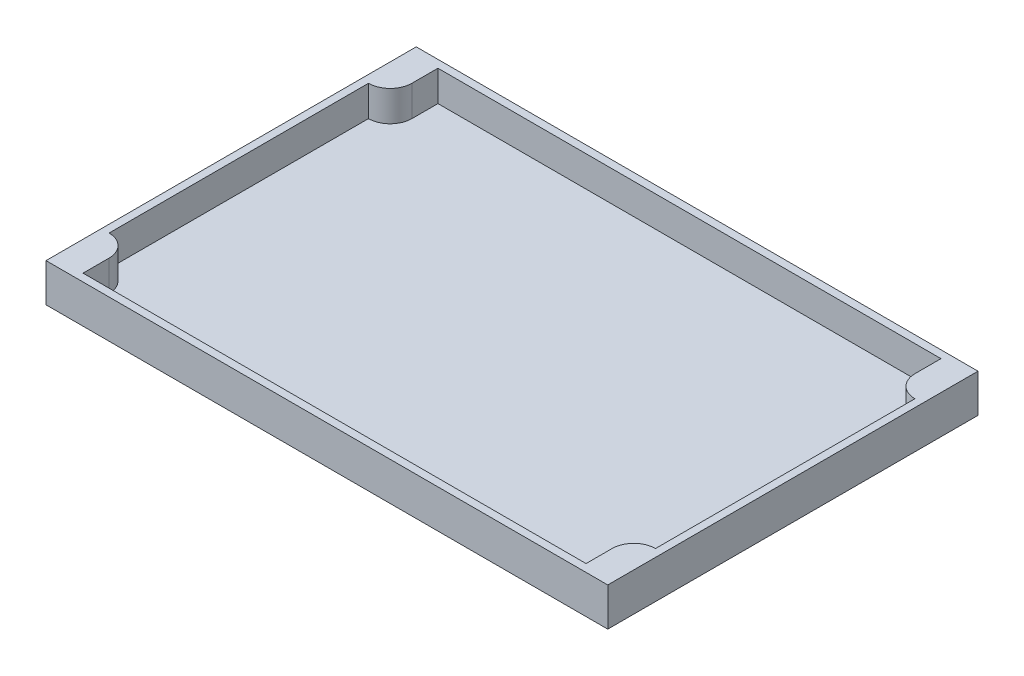
ISO-10303-21;
HEADER;
FILE_DESCRIPTION(('STEP AP214'),'2;1');
FILE_NAME('part.step','',(''),(''),'','','');
FILE_SCHEMA(('AUTOMOTIVE_DESIGN { 1 0 10303 214 1 1 1 1 }'));
ENDSEC;
DATA;
#1=APPLICATION_CONTEXT('core data for automotive mechanical design processes');
#2=APPLICATION_PROTOCOL_DEFINITION('international standard','automotive_design',2000,#1);
#3=PRODUCT_CONTEXT('',#1,'mechanical');
#4=PRODUCT('Part','Part','',(#3));
#5=PRODUCT_RELATED_PRODUCT_CATEGORY('part','',(#4));
#6=PRODUCT_DEFINITION_FORMATION('','',#4);
#7=PRODUCT_DEFINITION_CONTEXT('part definition',#1,'design');
#8=PRODUCT_DEFINITION('design','',#6,#7);
#9=PRODUCT_DEFINITION_SHAPE('','',#8);
#10=(LENGTH_UNIT() NAMED_UNIT(*) SI_UNIT(.MILLI.,.METRE.));
#11=(NAMED_UNIT(*) PLANE_ANGLE_UNIT() SI_UNIT($,.RADIAN.));
#12=(NAMED_UNIT(*) SI_UNIT($,.STERADIAN.) SOLID_ANGLE_UNIT());
#13=UNCERTAINTY_MEASURE_WITH_UNIT(LENGTH_MEASURE(1.E-05),#10,'distance_accuracy_value','');
#14=(GEOMETRIC_REPRESENTATION_CONTEXT(3) GLOBAL_UNCERTAINTY_ASSIGNED_CONTEXT((#13)) GLOBAL_UNIT_ASSIGNED_CONTEXT((#10,
#11,#12)) REPRESENTATION_CONTEXT('',''));
#15=CARTESIAN_POINT('',(0.,0.,0.));
#16=DIRECTION('',(0.,0.,1.));
#17=DIRECTION('',(1.,0.,0.));
#18=AXIS2_PLACEMENT_3D('',#15,#16,#17);
#19=CARTESIAN_POINT('',(0.,3.,0.));
#20=DIRECTION('',(1.,0.,0.));
#21=DIRECTION('',(0.,0.,-1.));
#22=AXIS2_PLACEMENT_3D('',#19,#20,#21);
#23=PLANE('',#22);
#24=DIRECTION('',(0.,0.,1.));
#25=VECTOR('',#24,1.);
#26=CARTESIAN_POINT('',(0.,0.,0.));
#27=LINE('',#26,#25);
#28=CARTESIAN_POINT('',(0.,0.,-145.));
#29=VERTEX_POINT('',#28);
#30=CARTESIAN_POINT('',(0.,0.,0.));
#31=VERTEX_POINT('',#30);
#32=EDGE_CURVE('E181',#29,#31,#27,.T.);
#33=ORIENTED_EDGE('',*,*,#32,.T.);
#34=DIRECTION('',(0.,-1.,0.));
#35=VECTOR('',#34,1.);
#36=CARTESIAN_POINT('',(0.,3.,0.));
#37=LINE('',#36,#35);
#38=CARTESIAN_POINT('',(0.,15.,0.));
#39=VERTEX_POINT('',#38);
#40=EDGE_CURVE('E12',#39,#31,#37,.T.);
#41=ORIENTED_EDGE('',*,*,#40,.F.);
#42=DIRECTION('',(0.,0.,-1.));
#43=VECTOR('',#42,1.);
#44=CARTESIAN_POINT('',(0.,15.,0.));
#45=LINE('',#44,#43);
#46=CARTESIAN_POINT('',(0.,15.,-145.));
#47=VERTEX_POINT('',#46);
#48=EDGE_CURVE('E169',#39,#47,#45,.T.);
#49=ORIENTED_EDGE('',*,*,#48,.T.);
#50=DIRECTION('',(0.,-1.,0.));
#51=VECTOR('',#50,1.);
#52=CARTESIAN_POINT('',(0.,3.,-145.));
#53=LINE('',#52,#51);
#54=EDGE_CURVE('E156',#47,#29,#53,.T.);
#55=ORIENTED_EDGE('',*,*,#54,.T.);
#56=EDGE_LOOP('',(#33,#41,#49,#55));
#57=FACE_BOUND('',#56,.T.);
#58=ADVANCED_FACE('F35',(#57),#23,.F.);
#59=CARTESIAN_POINT('',(0.,3.,0.));
#60=DIRECTION('',(0.,0.,-1.));
#61=DIRECTION('',(-1.,0.,0.));
#62=AXIS2_PLACEMENT_3D('',#59,#60,#61);
#63=PLANE('',#62);
#64=DIRECTION('',(1.,0.,0.));
#65=VECTOR('',#64,1.);
#66=CARTESIAN_POINT('',(0.,0.,0.));
#67=LINE('',#66,#65);
#68=CARTESIAN_POINT('',(220.,0.,0.));
#69=VERTEX_POINT('',#68);
#70=EDGE_CURVE('E202',#31,#69,#67,.T.);
#71=ORIENTED_EDGE('',*,*,#70,.T.);
#72=DIRECTION('',(0.,-1.,0.));
#73=VECTOR('',#72,1.);
#74=CARTESIAN_POINT('',(220.,3.,0.));
#75=LINE('',#74,#73);
#76=CARTESIAN_POINT('',(220.,15.,0.));
#77=VERTEX_POINT('',#76);
#78=EDGE_CURVE('E42',#77,#69,#75,.T.);
#79=ORIENTED_EDGE('',*,*,#78,.F.);
#80=DIRECTION('',(-1.,0.,0.));
#81=VECTOR('',#80,1.);
#82=CARTESIAN_POINT('',(220.,15.,0.));
#83=LINE('',#82,#81);
#84=EDGE_CURVE('E166',#77,#39,#83,.T.);
#85=ORIENTED_EDGE('',*,*,#84,.T.);
#86=ORIENTED_EDGE('',*,*,#40,.T.);
#87=EDGE_LOOP('',(#71,#79,#85,#86));
#88=FACE_BOUND('',#87,.T.);
#89=ADVANCED_FACE('F211',(#88),#63,.F.);
#90=CARTESIAN_POINT('',(220.,3.,0.));
#91=DIRECTION('',(-1.,0.,0.));
#92=DIRECTION('',(0.,0.,1.));
#93=AXIS2_PLACEMENT_3D('',#90,#91,#92);
#94=PLANE('',#93);
#95=DIRECTION('',(0.,0.,-1.));
#96=VECTOR('',#95,1.);
#97=CARTESIAN_POINT('',(220.,0.,0.));
#98=LINE('',#97,#96);
#99=CARTESIAN_POINT('',(220.,0.,-145.));
#100=VERTEX_POINT('',#99);
#101=EDGE_CURVE('E154',#69,#100,#98,.T.);
#102=ORIENTED_EDGE('',*,*,#101,.T.);
#103=DIRECTION('',(0.,-1.,0.));
#104=VECTOR('',#103,1.);
#105=CARTESIAN_POINT('',(220.,3.,-145.));
#106=LINE('',#105,#104);
#107=CARTESIAN_POINT('',(220.,15.,-145.));
#108=VERTEX_POINT('',#107);
#109=EDGE_CURVE('E148',#108,#100,#106,.T.);
#110=ORIENTED_EDGE('',*,*,#109,.F.);
#111=DIRECTION('',(0.,0.,1.));
#112=VECTOR('',#111,1.);
#113=CARTESIAN_POINT('',(220.,15.,0.));
#114=LINE('',#113,#112);
#115=EDGE_CURVE('E152',#108,#77,#114,.T.);
#116=ORIENTED_EDGE('',*,*,#115,.T.);
#117=ORIENTED_EDGE('',*,*,#78,.T.);
#118=EDGE_LOOP('',(#102,#110,#116,#117));
#119=FACE_BOUND('',#118,.T.);
#120=ADVANCED_FACE('F150',(#119),#94,.F.);
#121=CARTESIAN_POINT('',(0.,3.,-145.));
#122=DIRECTION('',(0.,0.,1.));
#123=DIRECTION('',(1.,0.,0.));
#124=AXIS2_PLACEMENT_3D('',#121,#122,#123);
#125=PLANE('',#124);
#126=DIRECTION('',(-1.,0.,0.));
#127=VECTOR('',#126,1.);
#128=CARTESIAN_POINT('',(0.,0.,-145.));
#129=LINE('',#128,#127);
#130=EDGE_CURVE('E57',#100,#29,#129,.T.);
#131=ORIENTED_EDGE('',*,*,#130,.T.);
#132=ORIENTED_EDGE('',*,*,#54,.F.);
#133=DIRECTION('',(1.,0.,0.));
#134=VECTOR('',#133,1.);
#135=CARTESIAN_POINT('',(220.,15.,-145.));
#136=LINE('',#135,#134);
#137=EDGE_CURVE('E163',#47,#108,#136,.T.);
#138=ORIENTED_EDGE('',*,*,#137,.T.);
#139=ORIENTED_EDGE('',*,*,#109,.T.);
#140=EDGE_LOOP('',(#131,#132,#138,#139));
#141=FACE_BOUND('',#140,.T.);
#142=ADVANCED_FACE('F168',(#141),#125,.F.);
#143=CARTESIAN_POINT('',(0.,0.,0.));
#144=DIRECTION('',(0.,-1.,0.));
#145=DIRECTION('',(0.,0.,-1.));
#146=AXIS2_PLACEMENT_3D('',#143,#144,#145);
#147=PLANE('',#146);
#148=ORIENTED_EDGE('',*,*,#32,.F.);
#149=ORIENTED_EDGE('',*,*,#130,.F.);
#150=ORIENTED_EDGE('',*,*,#101,.F.);
#151=ORIENTED_EDGE('',*,*,#70,.F.);
#152=EDGE_LOOP('',(#148,#149,#150,#151));
#153=FACE_BOUND('',#152,.T.);
#154=ADVANCED_FACE('F209',(#153),#147,.T.);
#155=CARTESIAN_POINT('',(3.00000000000001,293.486242525108,-13.2));
#156=DIRECTION('',(0.,-1.,0.));
#157=DIRECTION('',(0.,0.,-1.));
#158=AXIS2_PLACEMENT_3D('',#155,#156,#157);
#159=CYLINDRICAL_SURFACE('',#158,8.5);
#160=CARTESIAN_POINT('',(3.00000000000001,15.,-13.2));
#161=DIRECTION('',(0.,-1.,0.));
#162=DIRECTION('',(0.,0.,-1.));
#163=AXIS2_PLACEMENT_3D('',#160,#161,#162);
#164=CIRCLE('',#163,8.5);
#165=CARTESIAN_POINT('',(11.5,15.,-13.2));
#166=VERTEX_POINT('',#165);
#167=CARTESIAN_POINT('',(3.,15.,-21.7));
#168=VERTEX_POINT('',#167);
#169=EDGE_CURVE('E175',#166,#168,#164,.F.);
#170=ORIENTED_EDGE('',*,*,#169,.F.);
#171=DIRECTION('',(0.,-1.,0.));
#172=VECTOR('',#171,1.);
#173=CARTESIAN_POINT('',(11.5,293.486242525108,-13.2));
#174=LINE('',#173,#172);
#175=CARTESIAN_POINT('',(11.5,3.,-13.2));
#176=VERTEX_POINT('',#175);
#177=EDGE_CURVE('E171',#166,#176,#174,.T.);
#178=ORIENTED_EDGE('',*,*,#177,.T.);
#179=CARTESIAN_POINT('',(3.00000000000001,3.,-13.2));
#180=DIRECTION('',(0.,-1.,0.));
#181=DIRECTION('',(0.,0.,-1.));
#182=AXIS2_PLACEMENT_3D('',#179,#180,#181);
#183=CIRCLE('',#182,8.5);
#184=CARTESIAN_POINT('',(3.,3.,-21.7));
#185=VERTEX_POINT('',#184);
#186=EDGE_CURVE('E49',#185,#176,#183,.T.);
#187=ORIENTED_EDGE('',*,*,#186,.F.);
#188=DIRECTION('',(0.,-1.,0.));
#189=VECTOR('',#188,1.);
#190=CARTESIAN_POINT('',(3.,293.486242525108,-21.7));
#191=LINE('',#190,#189);
#192=EDGE_CURVE('E178',#168,#185,#191,.T.);
#193=ORIENTED_EDGE('',*,*,#192,.F.);
#194=EDGE_LOOP('',(#170,#178,#187,#193));
#195=FACE_BOUND('',#194,.T.);
#196=ADVANCED_FACE('F278',(#195),#159,.T.);
#197=CARTESIAN_POINT('',(11.5,293.486242525108,-13.2));
#198=DIRECTION('',(1.,0.,0.));
#199=DIRECTION('',(0.,0.,-1.));
#200=AXIS2_PLACEMENT_3D('',#197,#198,#199);
#201=PLANE('',#200);
#202=DIRECTION('',(0.,0.,-1.));
#203=VECTOR('',#202,1.);
#204=CARTESIAN_POINT('',(11.5,15.,-13.2));
#205=LINE('',#204,#203);
#206=CARTESIAN_POINT('',(11.5,15.,-3.00000000000001));
#207=VERTEX_POINT('',#206);
#208=EDGE_CURVE('E179',#207,#166,#205,.T.);
#209=ORIENTED_EDGE('',*,*,#208,.F.);
#210=DIRECTION('',(0.,-1.,0.));
#211=VECTOR('',#210,1.);
#212=CARTESIAN_POINT('',(11.5,293.486242525108,-3.00000000000001));
#213=LINE('',#212,#211);
#214=CARTESIAN_POINT('',(11.5,3.,-3.00000000000001));
#215=VERTEX_POINT('',#214);
#216=EDGE_CURVE('E236',#207,#215,#213,.T.);
#217=ORIENTED_EDGE('',*,*,#216,.T.);
#218=DIRECTION('',(0.,0.,1.));
#219=VECTOR('',#218,1.);
#220=CARTESIAN_POINT('',(11.5,3.,-13.2));
#221=LINE('',#220,#219);
#222=EDGE_CURVE('E241',#176,#215,#221,.T.);
#223=ORIENTED_EDGE('',*,*,#222,.F.);
#224=ORIENTED_EDGE('',*,*,#177,.F.);
#225=EDGE_LOOP('',(#209,#217,#223,#224));
#226=FACE_BOUND('',#225,.T.);
#227=ADVANCED_FACE('F284',(#226),#201,.T.);
#228=CARTESIAN_POINT('',(11.5,293.486242525108,-3.00000000000001));
#229=DIRECTION('',(0.,0.,-1.));
#230=DIRECTION('',(-1.,0.,0.));
#231=AXIS2_PLACEMENT_3D('',#228,#229,#230);
#232=PLANE('',#231);
#233=DIRECTION('',(-1.,0.,0.));
#234=VECTOR('',#233,1.);
#235=CARTESIAN_POINT('',(11.5,15.,-3.00000000000001));
#236=LINE('',#235,#234);
#237=CARTESIAN_POINT('',(208.5,15.,-3.00000000000003));
#238=VERTEX_POINT('',#237);
#239=EDGE_CURVE('E182',#238,#207,#236,.T.);
#240=ORIENTED_EDGE('',*,*,#239,.F.);
#241=DIRECTION('',(0.,-1.,0.));
#242=VECTOR('',#241,1.);
#243=CARTESIAN_POINT('',(208.5,293.486242525108,-3.00000000000003));
#244=LINE('',#243,#242);
#245=CARTESIAN_POINT('',(208.5,3.,-3.00000000000003));
#246=VERTEX_POINT('',#245);
#247=EDGE_CURVE('E234',#238,#246,#244,.T.);
#248=ORIENTED_EDGE('',*,*,#247,.T.);
#249=DIRECTION('',(1.,0.,0.));
#250=VECTOR('',#249,1.);
#251=CARTESIAN_POINT('',(11.5,3.,-3.00000000000001));
#252=LINE('',#251,#250);
#253=EDGE_CURVE('E245',#215,#246,#252,.T.);
#254=ORIENTED_EDGE('',*,*,#253,.F.);
#255=ORIENTED_EDGE('',*,*,#216,.F.);
#256=EDGE_LOOP('',(#240,#248,#254,#255));
#257=FACE_BOUND('',#256,.T.);
#258=ADVANCED_FACE('F290',(#257),#232,.T.);
#259=CARTESIAN_POINT('',(208.5,293.486242525108,-13.2000000000001));
#260=DIRECTION('',(-1.,0.,0.));
#261=DIRECTION('',(0.,0.,1.));
#262=AXIS2_PLACEMENT_3D('',#259,#260,#261);
#263=PLANE('',#262);
#264=DIRECTION('',(0.,0.,1.));
#265=VECTOR('',#264,1.);
#266=CARTESIAN_POINT('',(208.5,15.,-13.2000000000001));
#267=LINE('',#266,#265);
#268=CARTESIAN_POINT('',(208.5,15.,-13.2000000000001));
#269=VERTEX_POINT('',#268);
#270=EDGE_CURVE('E184',#269,#238,#267,.T.);
#271=ORIENTED_EDGE('',*,*,#270,.F.);
#272=DIRECTION('',(0.,-1.,0.));
#273=VECTOR('',#272,1.);
#274=CARTESIAN_POINT('',(208.5,293.486242525108,-13.2000000000001));
#275=LINE('',#274,#273);
#276=CARTESIAN_POINT('',(208.5,3.,-13.2000000000001));
#277=VERTEX_POINT('',#276);
#278=EDGE_CURVE('E232',#269,#277,#275,.T.);
#279=ORIENTED_EDGE('',*,*,#278,.T.);
#280=DIRECTION('',(0.,0.,-1.));
#281=VECTOR('',#280,1.);
#282=CARTESIAN_POINT('',(208.5,3.,-13.2000000000001));
#283=LINE('',#282,#281);
#284=EDGE_CURVE('E248',#246,#277,#283,.T.);
#285=ORIENTED_EDGE('',*,*,#284,.F.);
#286=ORIENTED_EDGE('',*,*,#247,.F.);
#287=EDGE_LOOP('',(#271,#279,#285,#286));
#288=FACE_BOUND('',#287,.T.);
#289=ADVANCED_FACE('F294',(#288),#263,.T.);
#290=CARTESIAN_POINT('',(217.,293.486242525108,-13.2000000000001));
#291=DIRECTION('',(0.,-1.,0.));
#292=DIRECTION('',(0.,0.,-1.));
#293=AXIS2_PLACEMENT_3D('',#290,#291,#292);
#294=CYLINDRICAL_SURFACE('',#293,8.49999999999999);
#295=CARTESIAN_POINT('',(217.,15.,-13.2000000000001));
#296=DIRECTION('',(0.,-1.,0.));
#297=DIRECTION('',(0.,0.,-1.));
#298=AXIS2_PLACEMENT_3D('',#295,#296,#297);
#299=CIRCLE('',#298,8.49999999999999);
#300=CARTESIAN_POINT('',(217.,15.,-21.7));
#301=VERTEX_POINT('',#300);
#302=EDGE_CURVE('E186',#301,#269,#299,.F.);
#303=ORIENTED_EDGE('',*,*,#302,.F.);
#304=DIRECTION('',(0.,-1.,0.));
#305=VECTOR('',#304,1.);
#306=CARTESIAN_POINT('',(217.,293.486242525108,-21.7));
#307=LINE('',#306,#305);
#308=CARTESIAN_POINT('',(217.,3.,-21.7));
#309=VERTEX_POINT('',#308);
#310=EDGE_CURVE('E230',#301,#309,#307,.T.);
#311=ORIENTED_EDGE('',*,*,#310,.T.);
#312=CARTESIAN_POINT('',(217.,3.,-13.2000000000001));
#313=DIRECTION('',(0.,-1.,0.));
#314=DIRECTION('',(0.,0.,1.));
#315=AXIS2_PLACEMENT_3D('',#312,#313,#314);
#316=CIRCLE('',#315,8.49999999999999);
#317=EDGE_CURVE('E251',#277,#309,#316,.T.);
#318=ORIENTED_EDGE('',*,*,#317,.F.);
#319=ORIENTED_EDGE('',*,*,#278,.F.);
#320=EDGE_LOOP('',(#303,#311,#318,#319));
#321=FACE_BOUND('',#320,.T.);
#322=ADVANCED_FACE('F299',(#321),#294,.T.);
#323=CARTESIAN_POINT('',(217.,293.486242525108,-123.3));
#324=DIRECTION('',(-1.,0.,0.));
#325=DIRECTION('',(0.,0.,1.));
#326=AXIS2_PLACEMENT_3D('',#323,#324,#325);
#327=PLANE('',#326);
#328=DIRECTION('',(0.,0.,1.));
#329=VECTOR('',#328,1.);
#330=CARTESIAN_POINT('',(217.,15.,-123.3));
#331=LINE('',#330,#329);
#332=CARTESIAN_POINT('',(217.,15.,-123.3));
#333=VERTEX_POINT('',#332);
#334=EDGE_CURVE('E188',#333,#301,#331,.T.);
#335=ORIENTED_EDGE('',*,*,#334,.F.);
#336=DIRECTION('',(0.,-1.,0.));
#337=VECTOR('',#336,1.);
#338=CARTESIAN_POINT('',(217.,293.486242525108,-123.3));
#339=LINE('',#338,#337);
#340=CARTESIAN_POINT('',(217.,3.,-123.3));
#341=VERTEX_POINT('',#340);
#342=EDGE_CURVE('E228',#333,#341,#339,.T.);
#343=ORIENTED_EDGE('',*,*,#342,.T.);
#344=DIRECTION('',(0.,0.,-1.));
#345=VECTOR('',#344,1.);
#346=CARTESIAN_POINT('',(217.,3.,-123.3));
#347=LINE('',#346,#345);
#348=EDGE_CURVE('E254',#309,#341,#347,.T.);
#349=ORIENTED_EDGE('',*,*,#348,.F.);
#350=ORIENTED_EDGE('',*,*,#310,.F.);
#351=EDGE_LOOP('',(#335,#343,#349,#350));
#352=FACE_BOUND('',#351,.T.);
#353=ADVANCED_FACE('F305',(#352),#327,.T.);
#354=CARTESIAN_POINT('',(217.,293.486242525108,-131.8));
#355=DIRECTION('',(0.,-1.,0.));
#356=DIRECTION('',(0.,0.,-1.));
#357=AXIS2_PLACEMENT_3D('',#354,#355,#356);
#358=CYLINDRICAL_SURFACE('',#357,8.49999999999999);
#359=CARTESIAN_POINT('',(217.,15.,-131.8));
#360=DIRECTION('',(0.,-1.,0.));
#361=DIRECTION('',(0.,0.,-1.));
#362=AXIS2_PLACEMENT_3D('',#359,#360,#361);
#363=CIRCLE('',#362,8.49999999999999);
#364=CARTESIAN_POINT('',(208.5,15.,-131.8));
#365=VERTEX_POINT('',#364);
#366=EDGE_CURVE('E190',#365,#333,#363,.F.);
#367=ORIENTED_EDGE('',*,*,#366,.F.);
#368=DIRECTION('',(0.,-1.,0.));
#369=VECTOR('',#368,1.);
#370=CARTESIAN_POINT('',(208.5,293.486242525108,-131.8));
#371=LINE('',#370,#369);
#372=CARTESIAN_POINT('',(208.5,3.,-131.8));
#373=VERTEX_POINT('',#372);
#374=EDGE_CURVE('E226',#365,#373,#371,.T.);
#375=ORIENTED_EDGE('',*,*,#374,.T.);
#376=CARTESIAN_POINT('',(217.,3.,-131.8));
#377=DIRECTION('',(0.,-1.,0.));
#378=DIRECTION('',(0.,0.,-1.));
#379=AXIS2_PLACEMENT_3D('',#376,#377,#378);
#380=CIRCLE('',#379,8.49999999999999);
#381=EDGE_CURVE('E257',#341,#373,#380,.T.);
#382=ORIENTED_EDGE('',*,*,#381,.F.);
#383=ORIENTED_EDGE('',*,*,#342,.F.);
#384=EDGE_LOOP('',(#367,#375,#382,#383));
#385=FACE_BOUND('',#384,.T.);
#386=ADVANCED_FACE('F309',(#385),#358,.T.);
#387=CARTESIAN_POINT('',(208.5,293.486242525108,-131.8));
#388=DIRECTION('',(-1.,0.,0.));
#389=DIRECTION('',(0.,0.,1.));
#390=AXIS2_PLACEMENT_3D('',#387,#388,#389);
#391=PLANE('',#390);
#392=DIRECTION('',(0.,0.,1.));
#393=VECTOR('',#392,1.);
#394=CARTESIAN_POINT('',(208.5,15.,-131.8));
#395=LINE('',#394,#393);
#396=CARTESIAN_POINT('',(208.5,15.,-142.));
#397=VERTEX_POINT('',#396);
#398=EDGE_CURVE('E192',#397,#365,#395,.T.);
#399=ORIENTED_EDGE('',*,*,#398,.F.);
#400=DIRECTION('',(0.,-1.,0.));
#401=VECTOR('',#400,1.);
#402=CARTESIAN_POINT('',(208.5,293.486242525108,-142.));
#403=LINE('',#402,#401);
#404=CARTESIAN_POINT('',(208.5,3.,-142.));
#405=VERTEX_POINT('',#404);
#406=EDGE_CURVE('E224',#397,#405,#403,.T.);
#407=ORIENTED_EDGE('',*,*,#406,.T.);
#408=DIRECTION('',(0.,0.,-1.));
#409=VECTOR('',#408,1.);
#410=CARTESIAN_POINT('',(208.5,3.,-131.8));
#411=LINE('',#410,#409);
#412=EDGE_CURVE('E260',#373,#405,#411,.T.);
#413=ORIENTED_EDGE('',*,*,#412,.F.);
#414=ORIENTED_EDGE('',*,*,#374,.F.);
#415=EDGE_LOOP('',(#399,#407,#413,#414));
#416=FACE_BOUND('',#415,.T.);
#417=ADVANCED_FACE('F314',(#416),#391,.T.);
#418=CARTESIAN_POINT('',(11.5,293.486242525108,-142.));
#419=DIRECTION('',(0.,0.,1.));
#420=DIRECTION('',(1.,0.,0.));
#421=AXIS2_PLACEMENT_3D('',#418,#419,#420);
#422=PLANE('',#421);
#423=DIRECTION('',(1.,0.,0.));
#424=VECTOR('',#423,1.);
#425=CARTESIAN_POINT('',(11.5,15.,-142.));
#426=LINE('',#425,#424);
#427=CARTESIAN_POINT('',(11.5,15.,-142.));
#428=VERTEX_POINT('',#427);
#429=EDGE_CURVE('E194',#428,#397,#426,.T.);
#430=ORIENTED_EDGE('',*,*,#429,.F.);
#431=DIRECTION('',(0.,-1.,0.));
#432=VECTOR('',#431,1.);
#433=CARTESIAN_POINT('',(11.5,293.486242525108,-142.));
#434=LINE('',#433,#432);
#435=CARTESIAN_POINT('',(11.5,3.,-142.));
#436=VERTEX_POINT('',#435);
#437=EDGE_CURVE('E222',#428,#436,#434,.T.);
#438=ORIENTED_EDGE('',*,*,#437,.T.);
#439=DIRECTION('',(-1.,0.,0.));
#440=VECTOR('',#439,1.);
#441=CARTESIAN_POINT('',(11.5,3.,-142.));
#442=LINE('',#441,#440);
#443=EDGE_CURVE('E263',#405,#436,#442,.T.);
#444=ORIENTED_EDGE('',*,*,#443,.F.);
#445=ORIENTED_EDGE('',*,*,#406,.F.);
#446=EDGE_LOOP('',(#430,#438,#444,#445));
#447=FACE_BOUND('',#446,.T.);
#448=ADVANCED_FACE('F320',(#447),#422,.T.);
#449=CARTESIAN_POINT('',(11.5,293.486242525108,-131.8));
#450=DIRECTION('',(1.,0.,0.));
#451=DIRECTION('',(0.,0.,-1.));
#452=AXIS2_PLACEMENT_3D('',#449,#450,#451);
#453=PLANE('',#452);
#454=DIRECTION('',(0.,0.,-1.));
#455=VECTOR('',#454,1.);
#456=CARTESIAN_POINT('',(11.5,15.,-131.8));
#457=LINE('',#456,#455);
#458=CARTESIAN_POINT('',(11.5,15.,-131.8));
#459=VERTEX_POINT('',#458);
#460=EDGE_CURVE('E196',#459,#428,#457,.T.);
#461=ORIENTED_EDGE('',*,*,#460,.F.);
#462=DIRECTION('',(0.,-1.,0.));
#463=VECTOR('',#462,1.);
#464=CARTESIAN_POINT('',(11.5,293.486242525108,-131.8));
#465=LINE('',#464,#463);
#466=CARTESIAN_POINT('',(11.5,3.,-131.8));
#467=VERTEX_POINT('',#466);
#468=EDGE_CURVE('E220',#459,#467,#465,.T.);
#469=ORIENTED_EDGE('',*,*,#468,.T.);
#470=DIRECTION('',(0.,0.,1.));
#471=VECTOR('',#470,1.);
#472=CARTESIAN_POINT('',(11.5,3.,-131.8));
#473=LINE('',#472,#471);
#474=EDGE_CURVE('E214',#436,#467,#473,.T.);
#475=ORIENTED_EDGE('',*,*,#474,.F.);
#476=ORIENTED_EDGE('',*,*,#437,.F.);
#477=EDGE_LOOP('',(#461,#469,#475,#476));
#478=FACE_BOUND('',#477,.T.);
#479=ADVANCED_FACE('F324',(#478),#453,.T.);
#480=CARTESIAN_POINT('',(3.00000000000002,293.486242525108,-131.8));
#481=DIRECTION('',(0.,-1.,0.));
#482=DIRECTION('',(0.,0.,-1.));
#483=AXIS2_PLACEMENT_3D('',#480,#481,#482);
#484=CYLINDRICAL_SURFACE('',#483,8.49999999999998);
#485=CARTESIAN_POINT('',(3.00000000000002,15.,-131.8));
#486=DIRECTION('',(0.,-1.,0.));
#487=DIRECTION('',(0.,0.,-1.));
#488=AXIS2_PLACEMENT_3D('',#485,#486,#487);
#489=CIRCLE('',#488,8.49999999999998);
#490=CARTESIAN_POINT('',(3.00000000000001,15.,-123.3));
#491=VERTEX_POINT('',#490);
#492=EDGE_CURVE('E198',#491,#459,#489,.F.);
#493=ORIENTED_EDGE('',*,*,#492,.F.);
#494=DIRECTION('',(0.,-1.,0.));
#495=VECTOR('',#494,1.);
#496=CARTESIAN_POINT('',(3.00000000000001,293.486242525108,-123.3));
#497=LINE('',#496,#495);
#498=CARTESIAN_POINT('',(3.00000000000001,3.,-123.3));
#499=VERTEX_POINT('',#498);
#500=EDGE_CURVE('E218',#491,#499,#497,.T.);
#501=ORIENTED_EDGE('',*,*,#500,.T.);
#502=CARTESIAN_POINT('',(3.00000000000002,3.,-131.8));
#503=DIRECTION('',(0.,-1.,0.));
#504=DIRECTION('',(0.,0.,1.));
#505=AXIS2_PLACEMENT_3D('',#502,#503,#504);
#506=CIRCLE('',#505,8.49999999999998);
#507=EDGE_CURVE('E212',#467,#499,#506,.T.);
#508=ORIENTED_EDGE('',*,*,#507,.F.);
#509=ORIENTED_EDGE('',*,*,#468,.F.);
#510=EDGE_LOOP('',(#493,#501,#508,#509));
#511=FACE_BOUND('',#510,.T.);
#512=ADVANCED_FACE('F328',(#511),#484,.T.);
#513=CARTESIAN_POINT('',(3.00000000000001,293.486242525108,-123.3));
#514=DIRECTION('',(1.,0.,0.));
#515=DIRECTION('',(0.,0.,-1.));
#516=AXIS2_PLACEMENT_3D('',#513,#514,#515);
#517=PLANE('',#516);
#518=DIRECTION('',(0.,0.,-1.));
#519=VECTOR('',#518,1.);
#520=CARTESIAN_POINT('',(3.00000000000001,15.,-123.3));
#521=LINE('',#520,#519);
#522=EDGE_CURVE('E177',#168,#491,#521,.T.);
#523=ORIENTED_EDGE('',*,*,#522,.F.);
#524=ORIENTED_EDGE('',*,*,#192,.T.);
#525=DIRECTION('',(0.,0.,1.));
#526=VECTOR('',#525,1.);
#527=CARTESIAN_POINT('',(3.00000000000001,3.,-123.3));
#528=LINE('',#527,#526);
#529=EDGE_CURVE('E242',#499,#185,#528,.T.);
#530=ORIENTED_EDGE('',*,*,#529,.F.);
#531=ORIENTED_EDGE('',*,*,#500,.F.);
#532=EDGE_LOOP('',(#523,#524,#530,#531));
#533=FACE_BOUND('',#532,.T.);
#534=ADVANCED_FACE('F276',(#533),#517,.T.);
#535=CARTESIAN_POINT('',(0.,15.,0.));
#536=DIRECTION('',(0.,-1.,0.));
#537=DIRECTION('',(0.,0.,-1.));
#538=AXIS2_PLACEMENT_3D('',#535,#536,#537);
#539=PLANE('',#538);
#540=ORIENTED_EDGE('',*,*,#169,.T.);
#541=ORIENTED_EDGE('',*,*,#522,.T.);
#542=ORIENTED_EDGE('',*,*,#492,.T.);
#543=ORIENTED_EDGE('',*,*,#460,.T.);
#544=ORIENTED_EDGE('',*,*,#429,.T.);
#545=ORIENTED_EDGE('',*,*,#398,.T.);
#546=ORIENTED_EDGE('',*,*,#366,.T.);
#547=ORIENTED_EDGE('',*,*,#334,.T.);
#548=ORIENTED_EDGE('',*,*,#302,.T.);
#549=ORIENTED_EDGE('',*,*,#270,.T.);
#550=ORIENTED_EDGE('',*,*,#239,.T.);
#551=ORIENTED_EDGE('',*,*,#208,.T.);
#552=EDGE_LOOP('',(#540,#541,#542,#543,#544,#545,#546,#547,#548,#549,#550,#551));
#553=FACE_BOUND('',#552,.T.);
#554=ORIENTED_EDGE('',*,*,#115,.F.);
#555=ORIENTED_EDGE('',*,*,#137,.F.);
#556=ORIENTED_EDGE('',*,*,#48,.F.);
#557=ORIENTED_EDGE('',*,*,#84,.F.);
#558=EDGE_LOOP('',(#554,#555,#556,#557));
#559=FACE_BOUND('',#558,.T.);
#560=ADVANCED_FACE('F161',(#553,#559),#539,.F.);
#561=CARTESIAN_POINT('',(0.,3.,0.));
#562=DIRECTION('',(0.,-1.,0.));
#563=DIRECTION('',(0.,0.,-1.));
#564=AXIS2_PLACEMENT_3D('',#561,#562,#563);
#565=PLANE('',#564);
#566=ORIENTED_EDGE('',*,*,#529,.T.);
#567=ORIENTED_EDGE('',*,*,#186,.T.);
#568=ORIENTED_EDGE('',*,*,#222,.T.);
#569=ORIENTED_EDGE('',*,*,#253,.T.);
#570=ORIENTED_EDGE('',*,*,#284,.T.);
#571=ORIENTED_EDGE('',*,*,#317,.T.);
#572=ORIENTED_EDGE('',*,*,#348,.T.);
#573=ORIENTED_EDGE('',*,*,#381,.T.);
#574=ORIENTED_EDGE('',*,*,#412,.T.);
#575=ORIENTED_EDGE('',*,*,#443,.T.);
#576=ORIENTED_EDGE('',*,*,#474,.T.);
#577=ORIENTED_EDGE('',*,*,#507,.T.);
#578=EDGE_LOOP('',(#566,#567,#568,#569,#570,#571,#572,#573,#574,#575,#576,#577));
#579=FACE_BOUND('',#578,.T.);
#580=ADVANCED_FACE('F271',(#579),#565,.F.);
#581=CLOSED_SHELL('',(#58,#89,#120,#142,#154,#196,#227,#258,#289,#322,#353,#386,#417,#448,#479,
#512,#534,#560,#580));
#582=MANIFOLD_SOLID_BREP('B2',#581);
#583=ADVANCED_BREP_SHAPE_REPRESENTATION('',(#18,#582),#14);
#584=SHAPE_DEFINITION_REPRESENTATION(#9,#583);
ENDSEC;
END-ISO-10303-21;
